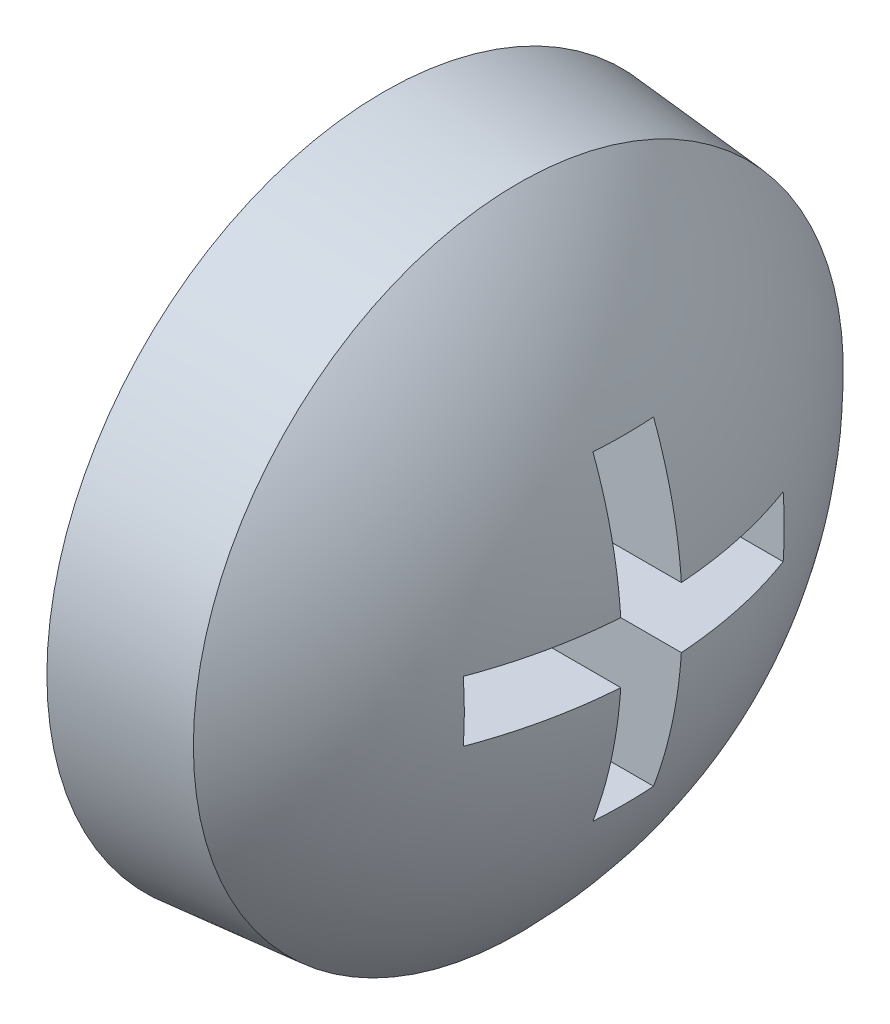
ISO-10303-21;
HEADER;
FILE_DESCRIPTION(('STEP AP214'),'2;1');
FILE_NAME('part.step','',(''),(''),'','','');
FILE_SCHEMA(('AUTOMOTIVE_DESIGN { 1 0 10303 214 1 1 1 1 }'));
ENDSEC;
DATA;
#1=APPLICATION_CONTEXT('core data for automotive mechanical design processes');
#2=APPLICATION_PROTOCOL_DEFINITION('international standard','automotive_design',2000,#1);
#3=PRODUCT_CONTEXT('',#1,'mechanical');
#4=PRODUCT('Part','Part','',(#3));
#5=PRODUCT_RELATED_PRODUCT_CATEGORY('part','',(#4));
#6=PRODUCT_DEFINITION_FORMATION('','',#4);
#7=PRODUCT_DEFINITION_CONTEXT('part definition',#1,'design');
#8=PRODUCT_DEFINITION('design','',#6,#7);
#9=PRODUCT_DEFINITION_SHAPE('','',#8);
#10=(LENGTH_UNIT() NAMED_UNIT(*) SI_UNIT(.MILLI.,.METRE.));
#11=(NAMED_UNIT(*) PLANE_ANGLE_UNIT() SI_UNIT($,.RADIAN.));
#12=(NAMED_UNIT(*) SI_UNIT($,.STERADIAN.) SOLID_ANGLE_UNIT());
#13=UNCERTAINTY_MEASURE_WITH_UNIT(LENGTH_MEASURE(1.E-05),#10,'distance_accuracy_value','');
#14=(GEOMETRIC_REPRESENTATION_CONTEXT(3) GLOBAL_UNCERTAINTY_ASSIGNED_CONTEXT((#13)) GLOBAL_UNIT_ASSIGNED_CONTEXT((#10,
#11,#12)) REPRESENTATION_CONTEXT('',''));
#15=CARTESIAN_POINT('',(0.,0.,0.));
#16=DIRECTION('',(0.,0.,1.));
#17=DIRECTION('',(1.,0.,0.));
#18=AXIS2_PLACEMENT_3D('',#15,#16,#17);
#19=CARTESIAN_POINT('',(219.066666666667,6.9,10.));
#20=DIRECTION('',(1.,0.,0.));
#21=DIRECTION('',(0.,0.,-1.));
#22=AXIS2_PLACEMENT_3D('',#19,#20,#21);
#23=PLANE('',#22);
#24=DIRECTION('',(0.,0.,1.));
#25=VECTOR('',#24,1.);
#26=CARTESIAN_POINT('',(219.066666666667,5.95,10.));
#27=LINE('',#26,#25);
#28=CARTESIAN_POINT('',(219.066666666667,5.95,9.82));
#29=VERTEX_POINT('',#28);
#30=CARTESIAN_POINT('',(219.066666666667,5.95,10.18));
#31=VERTEX_POINT('',#30);
#32=EDGE_CURVE('E293',#29,#31,#27,.T.);
#33=ORIENTED_EDGE('',*,*,#32,.F.);
#34=DIRECTION('',(0.,1.,0.));
#35=VECTOR('',#34,1.);
#36=CARTESIAN_POINT('',(219.066666666667,6.9,9.82));
#37=LINE('',#36,#35);
#38=CARTESIAN_POINT('',(219.066666666667,6.72,9.82));
#39=VERTEX_POINT('',#38);
#40=EDGE_CURVE('E298',#39,#29,#37,.F.);
#41=ORIENTED_EDGE('',*,*,#40,.F.);
#42=DIRECTION('',(0.,0.,1.));
#43=VECTOR('',#42,1.);
#44=CARTESIAN_POINT('',(219.066666666667,6.72,10.));
#45=LINE('',#44,#43);
#46=CARTESIAN_POINT('',(219.066666666667,6.72,9.05));
#47=VERTEX_POINT('',#46);
#48=EDGE_CURVE('E303',#47,#39,#45,.T.);
#49=ORIENTED_EDGE('',*,*,#48,.F.);
#50=DIRECTION('',(0.,1.,0.));
#51=VECTOR('',#50,1.);
#52=CARTESIAN_POINT('',(219.066666666667,6.9,9.05));
#53=LINE('',#52,#51);
#54=CARTESIAN_POINT('',(219.066666666667,7.08,9.05));
#55=VERTEX_POINT('',#54);
#56=EDGE_CURVE('E308',#55,#47,#53,.F.);
#57=ORIENTED_EDGE('',*,*,#56,.F.);
#58=DIRECTION('',(0.,0.,-1.));
#59=VECTOR('',#58,1.);
#60=CARTESIAN_POINT('',(219.066666666667,7.08,10.));
#61=LINE('',#60,#59);
#62=CARTESIAN_POINT('',(219.066666666667,7.08,9.82));
#63=VERTEX_POINT('',#62);
#64=EDGE_CURVE('E313',#63,#55,#61,.T.);
#65=ORIENTED_EDGE('',*,*,#64,.F.);
#66=DIRECTION('',(0.,1.,0.));
#67=VECTOR('',#66,1.);
#68=CARTESIAN_POINT('',(219.066666666667,6.9,9.82));
#69=LINE('',#68,#67);
#70=CARTESIAN_POINT('',(219.066666666667,7.85,9.82));
#71=VERTEX_POINT('',#70);
#72=EDGE_CURVE('E318',#71,#63,#69,.F.);
#73=ORIENTED_EDGE('',*,*,#72,.F.);
#74=DIRECTION('',(0.,0.,1.));
#75=VECTOR('',#74,1.);
#76=CARTESIAN_POINT('',(219.066666666667,7.85,10.));
#77=LINE('',#76,#75);
#78=CARTESIAN_POINT('',(219.066666666667,7.85,10.18));
#79=VERTEX_POINT('',#78);
#80=EDGE_CURVE('E267',#71,#79,#77,.T.);
#81=ORIENTED_EDGE('',*,*,#80,.T.);
#82=DIRECTION('',(0.,1.,0.));
#83=VECTOR('',#82,1.);
#84=CARTESIAN_POINT('',(219.066666666667,6.9,10.18));
#85=LINE('',#84,#83);
#86=CARTESIAN_POINT('',(219.066666666667,7.08,10.18));
#87=VERTEX_POINT('',#86);
#88=EDGE_CURVE('E264',#87,#79,#85,.T.);
#89=ORIENTED_EDGE('',*,*,#88,.F.);
#90=DIRECTION('',(0.,0.,-1.));
#91=VECTOR('',#90,1.);
#92=CARTESIAN_POINT('',(219.066666666667,7.08,10.));
#93=LINE('',#92,#91);
#94=CARTESIAN_POINT('',(219.066666666667,7.08,10.95));
#95=VERTEX_POINT('',#94);
#96=EDGE_CURVE('E260',#95,#87,#93,.T.);
#97=ORIENTED_EDGE('',*,*,#96,.F.);
#98=DIRECTION('',(0.,1.,0.));
#99=VECTOR('',#98,1.);
#100=CARTESIAN_POINT('',(219.066666666667,6.9,10.95));
#101=LINE('',#100,#99);
#102=CARTESIAN_POINT('',(219.066666666667,6.72,10.95));
#103=VERTEX_POINT('',#102);
#104=EDGE_CURVE('E231',#95,#103,#101,.F.);
#105=ORIENTED_EDGE('',*,*,#104,.T.);
#106=DIRECTION('',(0.,0.,1.));
#107=VECTOR('',#106,1.);
#108=CARTESIAN_POINT('',(219.066666666667,6.72,10.));
#109=LINE('',#108,#107);
#110=CARTESIAN_POINT('',(219.066666666667,6.72,10.18));
#111=VERTEX_POINT('',#110);
#112=EDGE_CURVE('E278',#111,#103,#109,.T.);
#113=ORIENTED_EDGE('',*,*,#112,.F.);
#114=DIRECTION('',(0.,1.,0.));
#115=VECTOR('',#114,1.);
#116=CARTESIAN_POINT('',(219.066666666667,6.9,10.18));
#117=LINE('',#116,#115);
#118=EDGE_CURVE('E288',#31,#111,#117,.T.);
#119=ORIENTED_EDGE('',*,*,#118,.F.);
#120=EDGE_LOOP('',(#33,#41,#49,#57,#65,#73,#81,#89,#97,#105,#113,#119));
#121=FACE_BOUND('',#120,.T.);
#122=ADVANCED_FACE('F17',(#121),#23,.T.);
#123=CARTESIAN_POINT('',(219.666666666667,7.08,10.));
#124=DIRECTION('',(0.,-1.,0.));
#125=DIRECTION('',(0.,0.,-1.));
#126=AXIS2_PLACEMENT_3D('',#123,#124,#125);
#127=PLANE('',#126);
#128=DIRECTION('',(1.,0.,0.));
#129=VECTOR('',#128,1.);
#130=CARTESIAN_POINT('',(219.666666666667,7.08,10.95));
#131=LINE('',#130,#129);
#132=CARTESIAN_POINT('',(220.089571189858,7.08,10.9499999999999));
#133=VERTEX_POINT('',#132);
#134=EDGE_CURVE('E89',#133,#95,#131,.F.);
#135=ORIENTED_EDGE('',*,*,#134,.T.);
#136=ORIENTED_EDGE('',*,*,#96,.T.);
#137=DIRECTION('',(-1.,0.,0.));
#138=VECTOR('',#137,1.);
#139=CARTESIAN_POINT('',(219.666666666667,7.08,10.18));
#140=LINE('',#139,#138);
#141=CARTESIAN_POINT('',(220.254764236461,7.07999999999998,10.18));
#142=VERTEX_POINT('',#141);
#143=EDGE_CURVE('E224',#142,#87,#140,.T.);
#144=ORIENTED_EDGE('',*,*,#143,.F.);
#145=CARTESIAN_POINT('',(220.089571189858,7.08,10.9499999999998));
#146=CARTESIAN_POINT('',(220.101116204051,7.08,10.9189995540504));
#147=CARTESIAN_POINT('',(220.112095586435,7.08,10.8877884938065));
#148=CARTESIAN_POINT('',(220.132868784973,7.08,10.8251104536467));
#149=CARTESIAN_POINT('',(220.142667091984,7.08,10.7936449620739));
#150=CARTESIAN_POINT('',(220.161090632624,7.08,10.7304618501354));
#151=CARTESIAN_POINT('',(220.169718872253,7.08,10.6987451062671));
#152=CARTESIAN_POINT('',(220.18581062142,7.08,10.6350619663154));
#153=CARTESIAN_POINT('',(220.193275650242,7.08,10.6030959541241));
#154=CARTESIAN_POINT('',(220.207044828628,7.08,10.5389148788567));
#155=CARTESIAN_POINT('',(220.213348978193,7.08,10.5066998157807));
#156=CARTESIAN_POINT('',(220.224795725559,7.08,10.4420201537523));
#157=CARTESIAN_POINT('',(220.229936780304,7.08,10.4095552817085));
#158=CARTESIAN_POINT('',(220.239051828977,7.08,10.3443751591892));
#159=CARTESIAN_POINT('',(220.243022721906,7.08,10.3116594750372));
#160=CARTESIAN_POINT('',(220.249787708815,7.08,10.2459761632456));
#161=CARTESIAN_POINT('',(220.252577096634,7.08,10.2130080508537));
#162=CARTESIAN_POINT('',(220.25476423646,7.08,10.18));
#163=B_SPLINE_CURVE_WITH_KNOTS('',3,(#145,#146,#147,#148,#149,#150,#151,#152,#153,#154,#155,
#156,#157,#158,#159,#160,#161,#162),.UNSPECIFIED.,.F.,.F.,(4,2,2,2,2,2,2,2,4),(0.,
0.0992357442434007,0.198081387639233,0.296668072480423,0.395124892694009,0.493581712907595,
0.592168397748798,0.691014041144626,0.790249785388023),.UNSPECIFIED.);
#164=EDGE_CURVE('E20',#133,#142,#163,.T.);
#165=ORIENTED_EDGE('',*,*,#164,.F.);
#166=EDGE_LOOP('',(#135,#136,#144,#165));
#167=FACE_BOUND('',#166,.T.);
#168=ADVANCED_FACE('F221',(#167),#127,.T.);
#169=CARTESIAN_POINT('',(219.666666666667,6.9,10.18));
#170=DIRECTION('',(0.,0.,-1.));
#171=DIRECTION('',(-1.,0.,0.));
#172=AXIS2_PLACEMENT_3D('',#169,#170,#171);
#173=PLANE('',#172);
#174=ORIENTED_EDGE('',*,*,#88,.T.);
#175=DIRECTION('',(1.,0.,0.));
#176=VECTOR('',#175,1.);
#177=CARTESIAN_POINT('',(219.666666666667,7.85,10.18));
#178=LINE('',#177,#176);
#179=CARTESIAN_POINT('',(220.089571189858,7.85,10.18));
#180=VERTEX_POINT('',#179);
#181=EDGE_CURVE('E324',#79,#180,#178,.T.);
#182=ORIENTED_EDGE('',*,*,#181,.T.);
#183=CARTESIAN_POINT('',(220.25476423646,7.07999999999996,10.18));
#184=CARTESIAN_POINT('',(220.249110057772,7.16559008255577,10.18));
#185=CARTESIAN_POINT('',(220.239378570371,7.25090347737763,10.18));
#186=CARTESIAN_POINT('',(220.212011452855,7.4196590615976,10.18));
#187=CARTESIAN_POINT('',(220.194429898816,7.50311001948187,10.18));
#188=CARTESIAN_POINT('',(220.149700769254,7.67504249159032,10.18));
#189=CARTESIAN_POINT('',(220.121864706158,7.76334531100329,10.18));
#190=CARTESIAN_POINT('',(220.089571189858,7.8499999999998,10.18));
#191=B_SPLINE_CURVE_WITH_KNOTS('',3,(#183,#184,#185,#186,#187,#188,#189,#190),.UNSPECIFIED.,.F.,
.F.,(4,2,2,4),(0.,0.257221658829311,0.512698117737291,0.789983486231442),.UNSPECIFIED.);
#192=EDGE_CURVE('E213',#142,#180,#191,.T.);
#193=ORIENTED_EDGE('',*,*,#192,.F.);
#194=ORIENTED_EDGE('',*,*,#143,.T.);
#195=EDGE_LOOP('',(#174,#182,#193,#194));
#196=FACE_BOUND('',#195,.T.);
#197=ADVANCED_FACE('F204',(#196),#173,.T.);
#198=CARTESIAN_POINT('',(219.666666666667,7.85,10.));
#199=DIRECTION('',(0.,1.,0.));
#200=DIRECTION('',(0.,0.,1.));
#201=AXIS2_PLACEMENT_3D('',#198,#199,#200);
#202=PLANE('',#201);
#203=ORIENTED_EDGE('',*,*,#181,.F.);
#204=ORIENTED_EDGE('',*,*,#80,.F.);
#205=DIRECTION('',(1.,0.,0.));
#206=VECTOR('',#205,1.);
#207=CARTESIAN_POINT('',(219.666666666667,7.85,9.82));
#208=LINE('',#207,#206);
#209=CARTESIAN_POINT('',(220.089571189858,7.8499999999999,9.82));
#210=VERTEX_POINT('',#209);
#211=EDGE_CURVE('E320',#210,#71,#208,.F.);
#212=ORIENTED_EDGE('',*,*,#211,.F.);
#213=CARTESIAN_POINT('',(220.089571189857,7.85,10.18));
#214=CARTESIAN_POINT('',(220.093799585556,7.85000000000002,10.12));
#215=CARTESIAN_POINT('',(220.095913783405,7.85000000000002,10.06));
#216=CARTESIAN_POINT('',(220.095913783405,7.84999999999998,9.93999999999997));
#217=CARTESIAN_POINT('',(220.093799585556,7.84999999999994,9.87999999999998));
#218=CARTESIAN_POINT('',(220.089571189857,7.84999999999989,9.81999999999998));
#219=B_SPLINE_CURVE_WITH_KNOTS('',3,(#213,#214,#215,#216,#217,#218),.UNSPECIFIED.,.F.,.F.,(4,2,
4),(0.,0.180111711148676,0.360223422297352),.UNSPECIFIED.);
#220=EDGE_CURVE('E207',#180,#210,#219,.T.);
#221=ORIENTED_EDGE('',*,*,#220,.F.);
#222=EDGE_LOOP('',(#203,#204,#212,#221));
#223=FACE_BOUND('',#222,.T.);
#224=ADVANCED_FACE('F199',(#223),#202,.F.);
#225=CARTESIAN_POINT('',(219.666666666667,6.9,9.82));
#226=DIRECTION('',(0.,0.,1.));
#227=DIRECTION('',(1.,0.,0.));
#228=AXIS2_PLACEMENT_3D('',#225,#226,#227);
#229=PLANE('',#228);
#230=ORIENTED_EDGE('',*,*,#72,.T.);
#231=DIRECTION('',(1.,0.,0.));
#232=VECTOR('',#231,1.);
#233=CARTESIAN_POINT('',(219.666666666667,7.08,9.82));
#234=LINE('',#233,#232);
#235=CARTESIAN_POINT('',(220.254764236461,7.08,9.82000000000002));
#236=VERTEX_POINT('',#235);
#237=EDGE_CURVE('E315',#236,#63,#234,.F.);
#238=ORIENTED_EDGE('',*,*,#237,.F.);
#239=CARTESIAN_POINT('',(220.089571189858,7.8499999999998,9.82));
#240=CARTESIAN_POINT('',(220.101116204051,7.81899955405039,9.82));
#241=CARTESIAN_POINT('',(220.112095586435,7.78778849380654,9.82));
#242=CARTESIAN_POINT('',(220.132868784973,7.72511045364667,9.82));
#243=CARTESIAN_POINT('',(220.142667091984,7.69364496207388,9.82));
#244=CARTESIAN_POINT('',(220.161090632624,7.63046185013544,9.82));
#245=CARTESIAN_POINT('',(220.169718872253,7.5987451062671,9.82));
#246=CARTESIAN_POINT('',(220.18581062142,7.53506196631537,9.82));
#247=CARTESIAN_POINT('',(220.193275650242,7.50309595412405,9.82));
#248=CARTESIAN_POINT('',(220.207044828628,7.43891487885671,9.82));
#249=CARTESIAN_POINT('',(220.213348978193,7.40669981578069,9.82));
#250=CARTESIAN_POINT('',(220.224795725559,7.3420201537523,9.82));
#251=CARTESIAN_POINT('',(220.229936780304,7.30955528170848,9.82));
#252=CARTESIAN_POINT('',(220.239051828977,7.24437515918925,9.82));
#253=CARTESIAN_POINT('',(220.243022721906,7.21165947503716,9.82));
#254=CARTESIAN_POINT('',(220.249787708815,7.14597616324555,9.82));
#255=CARTESIAN_POINT('',(220.252577096634,7.11300805085374,9.82));
#256=CARTESIAN_POINT('',(220.25476423646,7.07999999999997,9.82));
#257=B_SPLINE_CURVE_WITH_KNOTS('',3,(#239,#240,#241,#242,#243,#244,#245,#246,#247,#248,#249,
#250,#251,#252,#253,#254,#255,#256),.UNSPECIFIED.,.F.,.F.,(4,2,2,2,2,2,2,2,4),(0.,
0.0992357442433999,0.198081387639232,0.296668072480423,0.395124892694007,0.493581712907592,
0.592168397748795,0.691014041144625,0.79024978538802),.UNSPECIFIED.);
#258=EDGE_CURVE('E184',#210,#236,#257,.T.);
#259=ORIENTED_EDGE('',*,*,#258,.F.);
#260=ORIENTED_EDGE('',*,*,#211,.T.);
#261=EDGE_LOOP('',(#230,#238,#259,#260));
#262=FACE_BOUND('',#261,.T.);
#263=ADVANCED_FACE('F194',(#262),#229,.T.);
#264=CARTESIAN_POINT('',(219.666666666667,7.08,10.));
#265=DIRECTION('',(0.,-1.,0.));
#266=DIRECTION('',(0.,0.,-1.));
#267=AXIS2_PLACEMENT_3D('',#264,#265,#266);
#268=PLANE('',#267);
#269=DIRECTION('',(1.,0.,0.));
#270=VECTOR('',#269,1.);
#271=CARTESIAN_POINT('',(219.666666666667,7.08,9.05));
#272=LINE('',#271,#270);
#273=CARTESIAN_POINT('',(220.089571189858,7.08,9.05));
#274=VERTEX_POINT('',#273);
#275=EDGE_CURVE('E310',#274,#55,#272,.F.);
#276=ORIENTED_EDGE('',*,*,#275,.F.);
#277=CARTESIAN_POINT('',(220.25476423646,7.08,9.82000000000004));
#278=CARTESIAN_POINT('',(220.249110057772,7.08,9.73440991744424));
#279=CARTESIAN_POINT('',(220.239378570371,7.08,9.64909652262238));
#280=CARTESIAN_POINT('',(220.212011452855,7.08,9.4803409384024));
#281=CARTESIAN_POINT('',(220.194429898816,7.08,9.39688998051813));
#282=CARTESIAN_POINT('',(220.149700769254,7.08,9.22495750840968));
#283=CARTESIAN_POINT('',(220.121864706158,7.08,9.13665468899671));
#284=CARTESIAN_POINT('',(220.089571189858,7.08,9.0500000000002));
#285=B_SPLINE_CURVE_WITH_KNOTS('',3,(#277,#278,#279,#280,#281,#282,#283,#284),.UNSPECIFIED.,.F.,
.F.,(4,2,2,4),(0.,0.257221658829309,0.51269811773729,0.789983486231444),.UNSPECIFIED.);
#286=EDGE_CURVE('E176',#236,#274,#285,.T.);
#287=ORIENTED_EDGE('',*,*,#286,.F.);
#288=ORIENTED_EDGE('',*,*,#237,.T.);
#289=ORIENTED_EDGE('',*,*,#64,.T.);
#290=EDGE_LOOP('',(#276,#287,#288,#289));
#291=FACE_BOUND('',#290,.T.);
#292=ADVANCED_FACE('F191',(#291),#268,.T.);
#293=CARTESIAN_POINT('',(219.666666666667,6.9,9.05));
#294=DIRECTION('',(0.,0.,1.));
#295=DIRECTION('',(1.,0.,0.));
#296=AXIS2_PLACEMENT_3D('',#293,#294,#295);
#297=PLANE('',#296);
#298=DIRECTION('',(1.,0.,0.));
#299=VECTOR('',#298,1.);
#300=CARTESIAN_POINT('',(219.666666666667,6.72,9.05));
#301=LINE('',#300,#299);
#302=CARTESIAN_POINT('',(220.089571189858,6.72,9.0500000000001));
#303=VERTEX_POINT('',#302);
#304=EDGE_CURVE('E305',#303,#47,#301,.F.);
#305=ORIENTED_EDGE('',*,*,#304,.F.);
#306=CARTESIAN_POINT('',(220.089571189858,6.72,9.05));
#307=CARTESIAN_POINT('',(220.095913783405,6.80988825418754,9.05));
#308=CARTESIAN_POINT('',(220.095913783405,6.9,9.05));
#309=B_SPLINE_CURVE_WITH_KNOTS('',2,(#306,#307,#308),.UNSPECIFIED.,.F.,.F.,(3,3),(0.,1.),.UNSPECIFIED.);
#310=CARTESIAN_POINT('',(220.095913783405,6.9,9.05));
#311=VERTEX_POINT('',#310);
#312=EDGE_CURVE('E175',#311,#303,#309,.F.);
#313=ORIENTED_EDGE('',*,*,#312,.F.);
#314=CARTESIAN_POINT('',(220.095913783405,6.9,9.05));
#315=CARTESIAN_POINT('',(220.095913783405,6.99011174581247,9.05));
#316=CARTESIAN_POINT('',(220.089571189858,7.08,9.05));
#317=B_SPLINE_CURVE_WITH_KNOTS('',2,(#314,#315,#316),.UNSPECIFIED.,.F.,.F.,(3,3),(0.,1.),.UNSPECIFIED.);
#318=EDGE_CURVE('E183',#274,#311,#317,.F.);
#319=ORIENTED_EDGE('',*,*,#318,.F.);
#320=ORIENTED_EDGE('',*,*,#275,.T.);
#321=ORIENTED_EDGE('',*,*,#56,.T.);
#322=EDGE_LOOP('',(#305,#313,#319,#320,#321));
#323=FACE_BOUND('',#322,.T.);
#324=ADVANCED_FACE('F164',(#323),#297,.T.);
#325=CARTESIAN_POINT('',(219.666666666667,6.72,10.));
#326=DIRECTION('',(0.,1.,0.));
#327=DIRECTION('',(0.,0.,1.));
#328=AXIS2_PLACEMENT_3D('',#325,#326,#327);
#329=PLANE('',#328);
#330=ORIENTED_EDGE('',*,*,#304,.T.);
#331=ORIENTED_EDGE('',*,*,#48,.T.);
#332=DIRECTION('',(1.,0.,0.));
#333=VECTOR('',#332,1.);
#334=CARTESIAN_POINT('',(219.666666666667,6.72,9.82));
#335=LINE('',#334,#333);
#336=CARTESIAN_POINT('',(220.254764236461,6.72000000000002,9.82));
#337=VERTEX_POINT('',#336);
#338=EDGE_CURVE('E300',#337,#39,#335,.F.);
#339=ORIENTED_EDGE('',*,*,#338,.F.);
#340=CARTESIAN_POINT('',(220.089571189858,6.72,9.0500000000002));
#341=CARTESIAN_POINT('',(220.101116204051,6.72,9.08100044594961));
#342=CARTESIAN_POINT('',(220.112095586435,6.72,9.11221150619346));
#343=CARTESIAN_POINT('',(220.132868784973,6.72,9.17488954635333));
#344=CARTESIAN_POINT('',(220.142667091984,6.72,9.20635503792612));
#345=CARTESIAN_POINT('',(220.161090632624,6.72,9.26953814986456));
#346=CARTESIAN_POINT('',(220.169718872253,6.72,9.3012548937329));
#347=CARTESIAN_POINT('',(220.18581062142,6.72,9.36493803368463));
#348=CARTESIAN_POINT('',(220.193275650242,6.72,9.39690404587595));
#349=CARTESIAN_POINT('',(220.207044828628,6.72,9.46108512114329));
#350=CARTESIAN_POINT('',(220.213348978193,6.72,9.49330018421931));
#351=CARTESIAN_POINT('',(220.224795725559,6.72,9.5579798462477));
#352=CARTESIAN_POINT('',(220.229936780304,6.72,9.59044471829152));
#353=CARTESIAN_POINT('',(220.239051828977,6.72,9.65562484081075));
#354=CARTESIAN_POINT('',(220.243022721906,6.72,9.68834052496284));
#355=CARTESIAN_POINT('',(220.249787708815,6.72,9.75402383675444));
#356=CARTESIAN_POINT('',(220.252577096634,6.72,9.78699194914626));
#357=CARTESIAN_POINT('',(220.25476423646,6.72,9.82000000000003));
#358=B_SPLINE_CURVE_WITH_KNOTS('',3,(#340,#341,#342,#343,#344,#345,#346,#347,#348,#349,#350,
#351,#352,#353,#354,#355,#356,#357),.UNSPECIFIED.,.F.,.F.,(4,2,2,2,2,2,2,2,4),(0.,
0.0992357442433991,0.198081387639233,0.296668072480423,0.395124892694009,0.493581712907594,
0.592168397748797,0.691014041144626,0.790249785388021),.UNSPECIFIED.);
#359=EDGE_CURVE('E168',#303,#337,#358,.T.);
#360=ORIENTED_EDGE('',*,*,#359,.F.);
#361=EDGE_LOOP('',(#330,#331,#339,#360));
#362=FACE_BOUND('',#361,.T.);
#363=ADVANCED_FACE('F159',(#362),#329,.T.);
#364=CARTESIAN_POINT('',(219.666666666667,6.9,9.82));
#365=DIRECTION('',(0.,0.,1.));
#366=DIRECTION('',(1.,0.,0.));
#367=AXIS2_PLACEMENT_3D('',#364,#365,#366);
#368=PLANE('',#367);
#369=ORIENTED_EDGE('',*,*,#40,.T.);
#370=DIRECTION('',(1.,0.,0.));
#371=VECTOR('',#370,1.);
#372=CARTESIAN_POINT('',(219.666666666667,5.95,9.82));
#373=LINE('',#372,#371);
#374=CARTESIAN_POINT('',(220.089571189858,5.95,9.82000000000002));
#375=VERTEX_POINT('',#374);
#376=EDGE_CURVE('E295',#375,#29,#373,.F.);
#377=ORIENTED_EDGE('',*,*,#376,.F.);
#378=CARTESIAN_POINT('',(220.25476423646,6.72000000000004,9.82));
#379=CARTESIAN_POINT('',(220.249110057772,6.63440991744423,9.82));
#380=CARTESIAN_POINT('',(220.239378570371,6.54909652262237,9.82));
#381=CARTESIAN_POINT('',(220.212011452855,6.38034093840239,9.82));
#382=CARTESIAN_POINT('',(220.194429898816,6.29688998051813,9.82));
#383=CARTESIAN_POINT('',(220.149700769254,6.12495750840967,9.82));
#384=CARTESIAN_POINT('',(220.121864706158,6.0366546889967,9.82));
#385=CARTESIAN_POINT('',(220.089571189858,5.95000000000019,9.82));
#386=B_SPLINE_CURVE_WITH_KNOTS('',3,(#378,#379,#380,#381,#382,#383,#384,#385),.UNSPECIFIED.,.F.,
.F.,(4,2,2,4),(0.,0.257221658829311,0.512698117737292,0.789983486231445),.UNSPECIFIED.);
#387=EDGE_CURVE('E144',#337,#375,#386,.T.);
#388=ORIENTED_EDGE('',*,*,#387,.F.);
#389=ORIENTED_EDGE('',*,*,#338,.T.);
#390=EDGE_LOOP('',(#369,#377,#388,#389));
#391=FACE_BOUND('',#390,.T.);
#392=ADVANCED_FACE('F154',(#391),#368,.T.);
#393=CARTESIAN_POINT('',(219.666666666667,5.95,10.));
#394=DIRECTION('',(0.,1.,0.));
#395=DIRECTION('',(0.,0.,1.));
#396=AXIS2_PLACEMENT_3D('',#393,#394,#395);
#397=PLANE('',#396);
#398=ORIENTED_EDGE('',*,*,#32,.T.);
#399=DIRECTION('',(-1.,0.,0.));
#400=VECTOR('',#399,1.);
#401=CARTESIAN_POINT('',(219.666666666667,5.95,10.18));
#402=LINE('',#401,#400);
#403=CARTESIAN_POINT('',(220.089571189858,5.9500000000001,10.18));
#404=VERTEX_POINT('',#403);
#405=EDGE_CURVE('E290',#404,#31,#402,.T.);
#406=ORIENTED_EDGE('',*,*,#405,.F.);
#407=CARTESIAN_POINT('',(220.089571189857,5.95,9.82000000000004));
#408=CARTESIAN_POINT('',(220.093799585556,5.94999999999999,9.88000000000004));
#409=CARTESIAN_POINT('',(220.095913783405,5.94999999999999,9.94000000000004));
#410=CARTESIAN_POINT('',(220.095913783405,5.95000000000001,10.06));
#411=CARTESIAN_POINT('',(220.093799585556,5.95000000000003,10.12));
#412=CARTESIAN_POINT('',(220.089571189857,5.95000000000006,10.18));
#413=B_SPLINE_CURVE_WITH_KNOTS('',3,(#407,#408,#409,#410,#411,#412),.UNSPECIFIED.,.F.,.F.,(4,2,
4),(0.,0.180111711148678,0.360223422297353),.UNSPECIFIED.);
#414=EDGE_CURVE('E137',#375,#404,#413,.T.);
#415=ORIENTED_EDGE('',*,*,#414,.F.);
#416=ORIENTED_EDGE('',*,*,#376,.T.);
#417=EDGE_LOOP('',(#398,#406,#415,#416));
#418=FACE_BOUND('',#417,.T.);
#419=ADVANCED_FACE('F151',(#418),#397,.T.);
#420=CARTESIAN_POINT('',(219.666666666667,6.9,10.18));
#421=DIRECTION('',(0.,0.,-1.));
#422=DIRECTION('',(-1.,0.,0.));
#423=AXIS2_PLACEMENT_3D('',#420,#421,#422);
#424=PLANE('',#423);
#425=ORIENTED_EDGE('',*,*,#118,.T.);
#426=DIRECTION('',(1.,0.,0.));
#427=VECTOR('',#426,1.);
#428=CARTESIAN_POINT('',(219.666666666667,6.72,10.18));
#429=LINE('',#428,#427);
#430=CARTESIAN_POINT('',(220.254764236461,6.72,10.18));
#431=VERTEX_POINT('',#430);
#432=EDGE_CURVE('E280',#431,#111,#429,.F.);
#433=ORIENTED_EDGE('',*,*,#432,.F.);
#434=CARTESIAN_POINT('',(220.089571189858,5.9500000000002,10.18));
#435=CARTESIAN_POINT('',(220.101116204051,5.98100044594961,10.18));
#436=CARTESIAN_POINT('',(220.112095586435,6.01221150619346,10.18));
#437=CARTESIAN_POINT('',(220.132868784973,6.07488954635333,10.18));
#438=CARTESIAN_POINT('',(220.142667091984,6.10635503792612,10.18));
#439=CARTESIAN_POINT('',(220.161090632624,6.16953814986456,10.18));
#440=CARTESIAN_POINT('',(220.169718872253,6.2012548937329,10.18));
#441=CARTESIAN_POINT('',(220.18581062142,6.26493803368463,10.18));
#442=CARTESIAN_POINT('',(220.193275650242,6.29690404587595,10.18));
#443=CARTESIAN_POINT('',(220.207044828628,6.36108512114329,10.18));
#444=CARTESIAN_POINT('',(220.213348978193,6.39330018421931,10.18));
#445=CARTESIAN_POINT('',(220.224795725559,6.4579798462477,10.18));
#446=CARTESIAN_POINT('',(220.229936780304,6.49044471829152,10.18));
#447=CARTESIAN_POINT('',(220.239051828977,6.55562484081075,10.18));
#448=CARTESIAN_POINT('',(220.243022721906,6.58834052496283,10.18));
#449=CARTESIAN_POINT('',(220.249787708815,6.65402383675444,10.18));
#450=CARTESIAN_POINT('',(220.252577096634,6.68699194914626,10.18));
#451=CARTESIAN_POINT('',(220.25476423646,6.72000000000003,10.18));
#452=B_SPLINE_CURVE_WITH_KNOTS('',3,(#434,#435,#436,#437,#438,#439,#440,#441,#442,#443,#444,
#445,#446,#447,#448,#449,#450,#451),.UNSPECIFIED.,.F.,.F.,(4,2,2,2,2,2,2,2,4),(0.,
0.0992357442434007,0.198081387639233,0.296668072480425,0.395124892694009,0.493581712907593,
0.592168397748798,0.691014041144627,0.790249785388023),.UNSPECIFIED.);
#453=EDGE_CURVE('E100',#404,#431,#452,.T.);
#454=ORIENTED_EDGE('',*,*,#453,.F.);
#455=ORIENTED_EDGE('',*,*,#405,.T.);
#456=EDGE_LOOP('',(#425,#433,#454,#455));
#457=FACE_BOUND('',#456,.T.);
#458=ADVANCED_FACE('F123',(#457),#424,.T.);
#459=CARTESIAN_POINT('',(219.666666666667,6.72,10.));
#460=DIRECTION('',(0.,1.,0.));
#461=DIRECTION('',(0.,0.,1.));
#462=AXIS2_PLACEMENT_3D('',#459,#460,#461);
#463=PLANE('',#462);
#464=DIRECTION('',(1.,0.,0.));
#465=VECTOR('',#464,1.);
#466=CARTESIAN_POINT('',(219.666666666667,6.72,10.95));
#467=LINE('',#466,#465);
#468=CARTESIAN_POINT('',(220.089571189858,6.72,10.95));
#469=VERTEX_POINT('',#468);
#470=EDGE_CURVE('E40',#103,#469,#467,.T.);
#471=ORIENTED_EDGE('',*,*,#470,.T.);
#472=CARTESIAN_POINT('',(220.25476423646,6.72,10.18));
#473=CARTESIAN_POINT('',(220.249110057772,6.72,10.2655900825558));
#474=CARTESIAN_POINT('',(220.239378570371,6.72,10.3509034773776));
#475=CARTESIAN_POINT('',(220.212011452855,6.72,10.5196590615976));
#476=CARTESIAN_POINT('',(220.194429898816,6.72,10.6031100194819));
#477=CARTESIAN_POINT('',(220.149700769254,6.72,10.7750424915903));
#478=CARTESIAN_POINT('',(220.121864706158,6.72,10.8633453110033));
#479=CARTESIAN_POINT('',(220.089571189858,6.72,10.9499999999998));
#480=B_SPLINE_CURVE_WITH_KNOTS('',3,(#472,#473,#474,#475,#476,#477,#478,#479),.UNSPECIFIED.,.F.,
.F.,(4,2,2,4),(0.,0.25722165882931,0.512698117737292,0.789983486231447),.UNSPECIFIED.);
#481=EDGE_CURVE('E96',#431,#469,#480,.T.);
#482=ORIENTED_EDGE('',*,*,#481,.F.);
#483=ORIENTED_EDGE('',*,*,#432,.T.);
#484=ORIENTED_EDGE('',*,*,#112,.T.);
#485=EDGE_LOOP('',(#471,#482,#483,#484));
#486=FACE_BOUND('',#485,.T.);
#487=ADVANCED_FACE('F115',(#486),#463,.T.);
#488=CARTESIAN_POINT('',(219.666666666667,6.9,10.95));
#489=DIRECTION('',(0.,0.,1.));
#490=DIRECTION('',(1.,0.,0.));
#491=AXIS2_PLACEMENT_3D('',#488,#489,#490);
#492=PLANE('',#491);
#493=ORIENTED_EDGE('',*,*,#470,.F.);
#494=ORIENTED_EDGE('',*,*,#104,.F.);
#495=ORIENTED_EDGE('',*,*,#134,.F.);
#496=CARTESIAN_POINT('',(220.095913783405,6.9,10.95));
#497=CARTESIAN_POINT('',(220.095913783405,6.99011174581247,10.95));
#498=CARTESIAN_POINT('',(220.089571189858,7.08,10.95));
#499=B_SPLINE_CURVE_WITH_KNOTS('',2,(#496,#497,#498),.UNSPECIFIED.,.F.,.F.,(3,3),(0.,1.),.UNSPECIFIED.);
#500=CARTESIAN_POINT('',(220.095913783405,6.9,10.95));
#501=VERTEX_POINT('',#500);
#502=EDGE_CURVE('E82',#501,#133,#499,.T.);
#503=ORIENTED_EDGE('',*,*,#502,.F.);
#504=CARTESIAN_POINT('',(220.089571189858,6.72,10.95));
#505=CARTESIAN_POINT('',(220.095913783405,6.80988825418754,10.95));
#506=CARTESIAN_POINT('',(220.095913783405,6.9,10.95));
#507=B_SPLINE_CURVE_WITH_KNOTS('',2,(#504,#505,#506),.UNSPECIFIED.,.F.,.F.,(3,3),(0.,1.),.UNSPECIFIED.);
#508=EDGE_CURVE('E85',#469,#501,#507,.T.);
#509=ORIENTED_EDGE('',*,*,#508,.F.);
#510=EDGE_LOOP('',(#493,#494,#495,#503,#509));
#511=FACE_BOUND('',#510,.T.);
#512=ADVANCED_FACE('F84',(#511),#492,.F.);
#513=CARTESIAN_POINT('',(217.53858228722,6.9,10.));
#514=DIRECTION('',(1.,0.,0.));
#515=DIRECTION('',(0.,1.,0.));
#516=AXIS2_PLACEMENT_3D('',#513,#514,#515);
#517=SPHERICAL_SURFACE('',#516,2.72808437944638);
#518=CARTESIAN_POINT('',(219.466666666676,6.9,10.));
#519=DIRECTION('',(-1.,0.,0.));
#520=DIRECTION('',(0.,0.,1.));
#521=AXIS2_PLACEMENT_3D('',#518,#519,#520);
#522=CIRCLE('',#521,1.93000906918229);
#523=CARTESIAN_POINT('',(219.466666666676,6.89999999999993,11.9300090691823));
#524=VERTEX_POINT('',#523);
#525=EDGE_CURVE('E31',#524,#524,#522,.T.);
#526=ORIENTED_EDGE('',*,*,#525,.F.);
#527=EDGE_LOOP('',(#526));
#528=FACE_BOUND('',#527,.T.);
#529=ORIENTED_EDGE('',*,*,#481,.T.);
#530=ORIENTED_EDGE('',*,*,#508,.T.);
#531=ORIENTED_EDGE('',*,*,#502,.T.);
#532=ORIENTED_EDGE('',*,*,#164,.T.);
#533=ORIENTED_EDGE('',*,*,#192,.T.);
#534=ORIENTED_EDGE('',*,*,#220,.T.);
#535=ORIENTED_EDGE('',*,*,#258,.T.);
#536=ORIENTED_EDGE('',*,*,#286,.T.);
#537=ORIENTED_EDGE('',*,*,#318,.T.);
#538=ORIENTED_EDGE('',*,*,#312,.T.);
#539=ORIENTED_EDGE('',*,*,#359,.T.);
#540=ORIENTED_EDGE('',*,*,#387,.T.);
#541=ORIENTED_EDGE('',*,*,#414,.T.);
#542=ORIENTED_EDGE('',*,*,#453,.T.);
#543=EDGE_LOOP('',(#529,#530,#531,#532,#533,#534,#535,#536,#537,#538,#539,#540,#541,#542));
#544=FACE_BOUND('',#543,.T.);
#545=ADVANCED_FACE('F94',(#528,#544),#517,.T.);
#546=CARTESIAN_POINT('',(218.66666666665,6.9,10.));
#547=DIRECTION('',(-1.,0.,0.));
#548=DIRECTION('',(0.,0.,1.));
#549=AXIS2_PLACEMENT_3D('',#546,#547,#548);
#550=CONICAL_SURFACE('',#549,2.00000000000045,0.0872664625936403);
#551=CARTESIAN_POINT('',(218.66666666665,6.9,10.));
#552=DIRECTION('',(-1.,0.,0.));
#553=DIRECTION('',(0.,0.,1.));
#554=AXIS2_PLACEMENT_3D('',#551,#552,#553);
#555=CIRCLE('',#554,2.00000000000045);
#556=CARTESIAN_POINT('',(218.66666666665,6.9,12.0000000000005));
#557=VERTEX_POINT('',#556);
#558=EDGE_CURVE('E11',#557,#557,#555,.T.);
#559=ORIENTED_EDGE('',*,*,#558,.F.);
#560=EDGE_LOOP('',(#559));
#561=FACE_BOUND('',#560,.T.);
#562=ORIENTED_EDGE('',*,*,#525,.T.);
#563=EDGE_LOOP('',(#562));
#564=FACE_BOUND('',#563,.T.);
#565=ADVANCED_FACE('F402',(#561,#564),#550,.T.);
#566=CARTESIAN_POINT('',(218.666666666667,6.9,11.));
#567=DIRECTION('',(-1.,0.,0.));
#568=DIRECTION('',(0.,0.,1.));
#569=AXIS2_PLACEMENT_3D('',#566,#567,#568);
#570=PLANE('',#569);
#571=ORIENTED_EDGE('',*,*,#558,.T.);
#572=EDGE_LOOP('',(#571));
#573=FACE_BOUND('',#572,.T.);
#574=ADVANCED_FACE('F400',(#573),#570,.T.);
#575=CLOSED_SHELL('',(#122,#168,#197,#224,#263,#292,#324,#363,#392,#419,#458,#487,#512,#545,
#565,#574));
#576=MANIFOLD_SOLID_BREP('B1',#575);
#577=ADVANCED_BREP_SHAPE_REPRESENTATION('',(#18,#576),#14);
#578=SHAPE_DEFINITION_REPRESENTATION(#9,#577);
ENDSEC;
END-ISO-10303-21;
